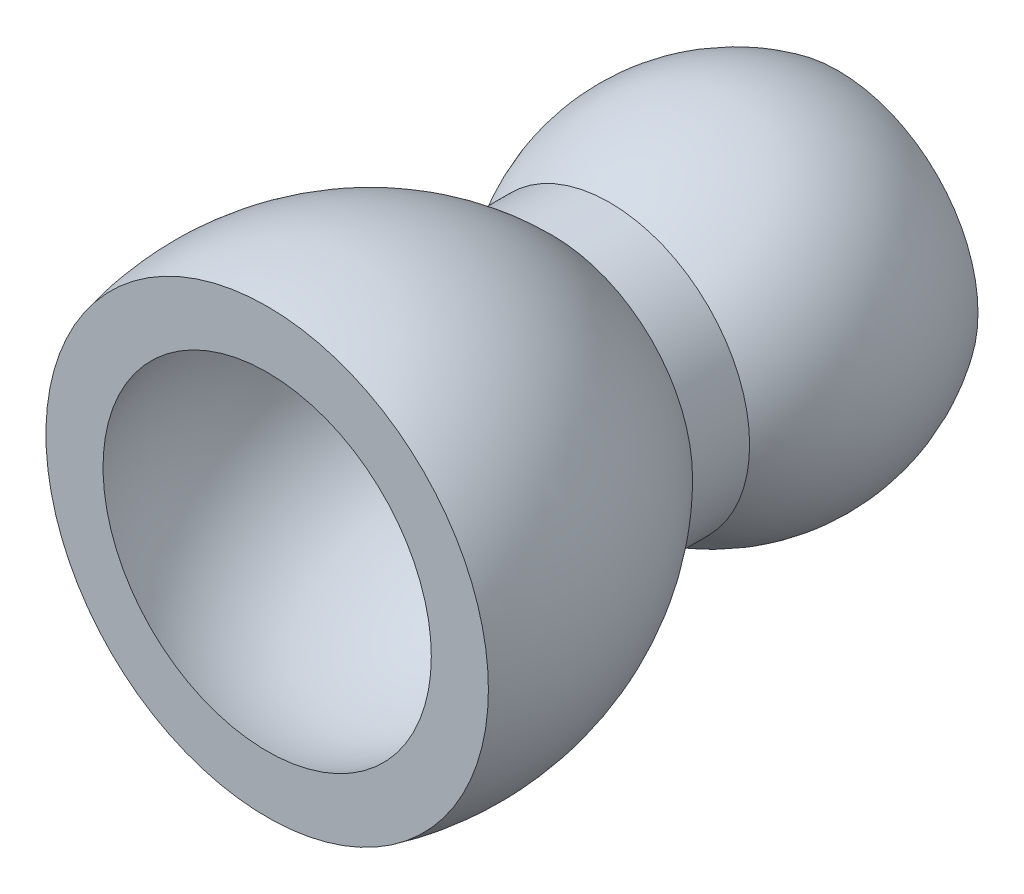
ISO-10303-21;
HEADER;
FILE_DESCRIPTION(('STEP AP214'),'2;1');
FILE_NAME('part.step','',(''),(''),'','','');
FILE_SCHEMA(('AUTOMOTIVE_DESIGN { 1 0 10303 214 1 1 1 1 }'));
ENDSEC;
DATA;
#1=APPLICATION_CONTEXT('core data for automotive mechanical design processes');
#2=APPLICATION_PROTOCOL_DEFINITION('international standard','automotive_design',2000,#1);
#3=PRODUCT_CONTEXT('',#1,'mechanical');
#4=PRODUCT('Part','Part','',(#3));
#5=PRODUCT_RELATED_PRODUCT_CATEGORY('part','',(#4));
#6=PRODUCT_DEFINITION_FORMATION('','',#4);
#7=PRODUCT_DEFINITION_CONTEXT('part definition',#1,'design');
#8=PRODUCT_DEFINITION('design','',#6,#7);
#9=PRODUCT_DEFINITION_SHAPE('','',#8);
#10=(LENGTH_UNIT() NAMED_UNIT(*) SI_UNIT(.MILLI.,.METRE.));
#11=(NAMED_UNIT(*) PLANE_ANGLE_UNIT() SI_UNIT($,.RADIAN.));
#12=(NAMED_UNIT(*) SI_UNIT($,.STERADIAN.) SOLID_ANGLE_UNIT());
#13=UNCERTAINTY_MEASURE_WITH_UNIT(LENGTH_MEASURE(1.E-05),#10,'distance_accuracy_value','');
#14=(GEOMETRIC_REPRESENTATION_CONTEXT(3) GLOBAL_UNCERTAINTY_ASSIGNED_CONTEXT((#13)) GLOBAL_UNIT_ASSIGNED_CONTEXT((#10,
#11,#12)) REPRESENTATION_CONTEXT('',''));
#15=CARTESIAN_POINT('',(0.,0.,0.));
#16=DIRECTION('',(0.,0.,1.));
#17=DIRECTION('',(1.,0.,0.));
#18=AXIS2_PLACEMENT_3D('',#15,#16,#17);
#19=CARTESIAN_POINT('',(0.,7.75,8.));
#20=DIRECTION('',(0.,0.,1.));
#21=DIRECTION('',(0.,-1.,0.));
#22=AXIS2_PLACEMENT_3D('',#19,#20,#21);
#23=PLANE('',#22);
#24=CARTESIAN_POINT('',(0.,0.,8.));
#25=DIRECTION('',(0.,0.,-1.));
#26=DIRECTION('',(1.,0.,0.));
#27=AXIS2_PLACEMENT_3D('',#24,#25,#26);
#28=CIRCLE('',#27,5.75);
#29=CARTESIAN_POINT('',(0.,5.75,8.));
#30=VERTEX_POINT('',#29);
#31=CARTESIAN_POINT('',(5.75,0.,8.));
#32=VERTEX_POINT('',#31);
#33=EDGE_CURVE('E29',#30,#32,#28,.T.);
#34=ORIENTED_EDGE('',*,*,#33,.T.);
#35=CARTESIAN_POINT('',(0.,0.,8.));
#36=DIRECTION('',(0.,0.,-1.));
#37=DIRECTION('',(1.,0.,0.));
#38=AXIS2_PLACEMENT_3D('',#35,#36,#37);
#39=CIRCLE('',#38,5.75);
#40=EDGE_CURVE('E11',#32,#30,#39,.T.);
#41=ORIENTED_EDGE('',*,*,#40,.T.);
#42=EDGE_LOOP('',(#34,#41));
#43=FACE_BOUND('',#42,.T.);
#44=CARTESIAN_POINT('',(0.,0.,8.));
#45=DIRECTION('',(0.,0.,-1.));
#46=DIRECTION('',(1.,0.,0.));
#47=AXIS2_PLACEMENT_3D('',#44,#45,#46);
#48=CIRCLE('',#47,7.75);
#49=CARTESIAN_POINT('',(0.,7.75,8.));
#50=VERTEX_POINT('',#49);
#51=CARTESIAN_POINT('',(7.75,0.,8.));
#52=VERTEX_POINT('',#51);
#53=EDGE_CURVE('E150',#50,#52,#48,.T.);
#54=ORIENTED_EDGE('',*,*,#53,.F.);
#55=CARTESIAN_POINT('',(0.,0.,8.));
#56=DIRECTION('',(0.,0.,-1.));
#57=DIRECTION('',(1.,0.,0.));
#58=AXIS2_PLACEMENT_3D('',#55,#56,#57);
#59=CIRCLE('',#58,7.75);
#60=EDGE_CURVE('E154',#52,#50,#59,.T.);
#61=ORIENTED_EDGE('',*,*,#60,.F.);
#62=EDGE_LOOP('',(#54,#61));
#63=FACE_BOUND('',#62,.T.);
#64=ADVANCED_FACE('F16',(#43,#63),#23,.T.);
#65=CARTESIAN_POINT('',(5.75,0.,8.));
#66=CARTESIAN_POINT('',(5.75,-5.75,7.99999999999999));
#67=CARTESIAN_POINT('',(0.,-5.75,8.));
#68=CARTESIAN_POINT('',(-5.75,-5.75,7.99999999999999));
#69=CARTESIAN_POINT('',(-5.75,0.,8.));
#70=CARTESIAN_POINT('',(-5.75,5.75,7.99999999999999));
#71=CARTESIAN_POINT('',(0.,5.75,8.));
#72=CARTESIAN_POINT('',(5.75,5.75,7.99999999999999));
#73=CARTESIAN_POINT('',(5.75,0.,8.));
#74=CARTESIAN_POINT('',(7.25472536348951,0.,3.43812600969305));
#75=CARTESIAN_POINT('',(7.2547253634895,-7.2547253634895,3.43812600969305));
#76=CARTESIAN_POINT('',(0.,-7.25472536348951,3.43812600969305));
#77=CARTESIAN_POINT('',(-7.2547253634895,-7.2547253634895,3.43812600969305));
#78=CARTESIAN_POINT('',(-7.25472536348951,0.,3.43812600969305));
#79=CARTESIAN_POINT('',(-7.2547253634895,7.2547253634895,3.43812600969305));
#80=CARTESIAN_POINT('',(0.,7.25472536348951,3.43812600969305));
#81=CARTESIAN_POINT('',(7.2547253634895,7.2547253634895,3.43812600969305));
#82=CARTESIAN_POINT('',(7.25472536348951,0.,3.43812600969305));
#83=CARTESIAN_POINT('',(3.9,0.,0.));
#84=CARTESIAN_POINT('',(3.9,-3.9,0.));
#85=CARTESIAN_POINT('',(0.,-3.9,0.));
#86=CARTESIAN_POINT('',(-3.9,-3.9,0.));
#87=CARTESIAN_POINT('',(-3.9,0.,0.));
#88=CARTESIAN_POINT('',(-3.9,3.9,0.));
#89=CARTESIAN_POINT('',(0.,3.9,0.));
#90=CARTESIAN_POINT('',(3.9,3.9,0.));
#91=CARTESIAN_POINT('',(3.9,0.,0.));
#92=(BOUNDED_SURFACE() B_SPLINE_SURFACE(2,2,((#65,#66,#67,#68,#69,#70,#71,#72,#73),(#74,#75,#76,
#77,#78,#79,#80,#81,#82),(#83,#84,#85,#86,#87,#88,#89,#90,#91)),.UNSPECIFIED.,.F.,.T.,
.F.) B_SPLINE_SURFACE_WITH_KNOTS((3,3),(3,2,2,2,3),(-0.318610550943975,0.773121072182338),
(-3.14159265358979,-1.5707963267949,0.,1.5707963267949,3.14159265358979),
.UNSPECIFIED.) GEOMETRIC_REPRESENTATION_ITEM() RATIONAL_B_SPLINE_SURFACE(((1.,0.707106781186548,
1.,0.707106781186548,1.,0.707106781186548,1.,0.707106781186548,1.),(0.85467811794493,
0.604348692930616,0.85467811794493,0.604348692930616,0.85467811794493,0.604348692930616,
0.85467811794493,0.604348692930616,0.85467811794493),(1.,0.707106781186548,1.,0.707106781186548,
1.,0.707106781186548,1.,0.707106781186548,1.))) REPRESENTATION_ITEM('') SURFACE());
#93=CARTESIAN_POINT('',(0.,0.,0.));
#94=DIRECTION('',(0.,0.,-1.));
#95=DIRECTION('',(1.,0.,0.));
#96=AXIS2_PLACEMENT_3D('',#93,#94,#95);
#97=CIRCLE('',#96,3.9);
#98=CARTESIAN_POINT('',(0.,3.9,0.));
#99=VERTEX_POINT('',#98);
#100=CARTESIAN_POINT('',(3.9,0.,0.));
#101=VERTEX_POINT('',#100);
#102=EDGE_CURVE('E141',#99,#101,#97,.T.);
#103=CARTESIAN_POINT('',(-1.76010638297872,0.,5.52280585106383));
#104=DIRECTION('',(0.,-1.,0.));
#105=DIRECTION('',(1.,0.,0.));
#106=AXIS2_PLACEMENT_3D('',#103,#104,#105);
#107=CIRCLE('',#106,7.90810904927223);
#108=EDGE_CURVE('E148',#101,#32,#107,.T.);
#109=CARTESIAN_POINT('',(0.,0.,0.));
#110=DIRECTION('',(0.,0.,-1.));
#111=DIRECTION('',(1.,0.,0.));
#112=AXIS2_PLACEMENT_3D('',#109,#110,#111);
#113=CIRCLE('',#112,3.9);
#114=CARTESIAN_POINT('',(0.,-3.9,0.));
#115=VERTEX_POINT('',#114);
#116=EDGE_CURVE('E146',#101,#115,#113,.T.);
#117=CARTESIAN_POINT('',(0.,0.,0.));
#118=DIRECTION('',(0.,0.,-1.));
#119=DIRECTION('',(1.,0.,0.));
#120=AXIS2_PLACEMENT_3D('',#117,#118,#119);
#121=CIRCLE('',#120,3.9);
#122=EDGE_CURVE('E145',#115,#99,#121,.T.);
#123=ORIENTED_EDGE('',*,*,#102,.T.);
#124=ORIENTED_EDGE('',*,*,#108,.T.);
#125=ORIENTED_EDGE('',*,*,#33,.F.);
#126=ORIENTED_EDGE('',*,*,#40,.F.);
#127=ORIENTED_EDGE('',*,*,#108,.F.);
#128=ORIENTED_EDGE('',*,*,#116,.T.);
#129=ORIENTED_EDGE('',*,*,#122,.T.);
#130=EDGE_LOOP('',(#123,#124,#125,#126,#127,#128,#129));
#131=FACE_BOUND('',#130,.T.);
#132=ADVANCED_FACE('F18',(#131),#92,.T.);
#133=CARTESIAN_POINT('',(0.,0.,-6.));
#134=DIRECTION('',(0.,0.,-1.));
#135=DIRECTION('',(0.,1.,0.));
#136=AXIS2_PLACEMENT_3D('',#133,#134,#135);
#137=CYLINDRICAL_SURFACE('',#136,3.9);
#138=CARTESIAN_POINT('',(0.,0.,-12.));
#139=DIRECTION('',(0.,0.,-1.));
#140=DIRECTION('',(1.,0.,0.));
#141=AXIS2_PLACEMENT_3D('',#138,#139,#140);
#142=CIRCLE('',#141,3.9);
#143=CARTESIAN_POINT('',(0.,3.9,-12.));
#144=VERTEX_POINT('',#143);
#145=CARTESIAN_POINT('',(0.,-3.9,-12.));
#146=VERTEX_POINT('',#145);
#147=EDGE_CURVE('E139',#144,#146,#142,.T.);
#148=ORIENTED_EDGE('',*,*,#147,.T.);
#149=DIRECTION('',(0.,0.,1.));
#150=VECTOR('',#149,1.);
#151=CARTESIAN_POINT('',(0.,-3.9,-6.));
#152=LINE('',#151,#150);
#153=EDGE_CURVE('E163',#146,#115,#152,.T.);
#154=ORIENTED_EDGE('',*,*,#153,.T.);
#155=ORIENTED_EDGE('',*,*,#116,.F.);
#156=ORIENTED_EDGE('',*,*,#102,.F.);
#157=ORIENTED_EDGE('',*,*,#122,.F.);
#158=ORIENTED_EDGE('',*,*,#153,.F.);
#159=CARTESIAN_POINT('',(0.,0.,-12.));
#160=DIRECTION('',(0.,0.,-1.));
#161=DIRECTION('',(1.,0.,0.));
#162=AXIS2_PLACEMENT_3D('',#159,#160,#161);
#163=CIRCLE('',#162,3.9);
#164=EDGE_CURVE('E97',#146,#144,#163,.T.);
#165=ORIENTED_EDGE('',*,*,#164,.T.);
#166=EDGE_LOOP('',(#148,#154,#155,#156,#157,#158,#165));
#167=FACE_BOUND('',#166,.T.);
#168=ADVANCED_FACE('F200',(#167),#137,.F.);
#169=CARTESIAN_POINT('',(0.,3.9,-12.));
#170=DIRECTION('',(0.,0.,-1.));
#171=DIRECTION('',(-1.,0.,0.));
#172=AXIS2_PLACEMENT_3D('',#169,#170,#171);
#173=PLANE('',#172);
#174=ORIENTED_EDGE('',*,*,#147,.F.);
#175=ORIENTED_EDGE('',*,*,#164,.F.);
#176=EDGE_LOOP('',(#174,#175));
#177=FACE_BOUND('',#176,.T.);
#178=CARTESIAN_POINT('',(0.,0.,-12.));
#179=DIRECTION('',(0.,0.,-1.));
#180=DIRECTION('',(1.,0.,0.));
#181=AXIS2_PLACEMENT_3D('',#178,#179,#180);
#182=CIRCLE('',#181,4.9);
#183=CARTESIAN_POINT('',(0.,4.9,-12.));
#184=VERTEX_POINT('',#183);
#185=CARTESIAN_POINT('',(4.9,0.,-12.));
#186=VERTEX_POINT('',#185);
#187=EDGE_CURVE('E155',#184,#186,#182,.T.);
#188=ORIENTED_EDGE('',*,*,#187,.T.);
#189=CARTESIAN_POINT('',(0.,0.,-12.));
#190=DIRECTION('',(0.,0.,-1.));
#191=DIRECTION('',(1.,0.,0.));
#192=AXIS2_PLACEMENT_3D('',#189,#190,#191);
#193=CIRCLE('',#192,4.9);
#194=EDGE_CURVE('E140',#186,#184,#193,.T.);
#195=ORIENTED_EDGE('',*,*,#194,.T.);
#196=EDGE_LOOP('',(#188,#195));
#197=FACE_BOUND('',#196,.T.);
#198=ADVANCED_FACE('F206',(#177,#197),#173,.T.);
#199=CARTESIAN_POINT('',(4.9,0.,-4.));
#200=CARTESIAN_POINT('',(4.9,-4.9,-4.));
#201=CARTESIAN_POINT('',(0.,-4.9,-4.));
#202=CARTESIAN_POINT('',(-4.9,-4.9,-4.));
#203=CARTESIAN_POINT('',(-4.9,0.,-4.));
#204=CARTESIAN_POINT('',(-4.9,4.9,-4.));
#205=CARTESIAN_POINT('',(0.,4.9,-4.));
#206=CARTESIAN_POINT('',(4.9,4.9,-4.));
#207=CARTESIAN_POINT('',(4.9,0.,-4.));
#208=CARTESIAN_POINT('',(7.67056277056278,0.,-8.));
#209=CARTESIAN_POINT('',(7.67056277056277,-7.67056277056277,-8.));
#210=CARTESIAN_POINT('',(0.,-7.67056277056278,-8.));
#211=CARTESIAN_POINT('',(-7.67056277056277,-7.67056277056277,-8.));
#212=CARTESIAN_POINT('',(-7.67056277056278,0.,-8.));
#213=CARTESIAN_POINT('',(-7.67056277056277,7.67056277056277,-8.));
#214=CARTESIAN_POINT('',(0.,7.67056277056278,-8.));
#215=CARTESIAN_POINT('',(7.67056277056277,7.67056277056277,-8.));
#216=CARTESIAN_POINT('',(7.67056277056278,0.,-8.));
#217=CARTESIAN_POINT('',(4.9,0.,-12.));
#218=CARTESIAN_POINT('',(4.9,-4.9,-12.));
#219=CARTESIAN_POINT('',(0.,-4.9,-12.));
#220=CARTESIAN_POINT('',(-4.9,-4.9,-12.));
#221=CARTESIAN_POINT('',(-4.9,0.,-12.));
#222=CARTESIAN_POINT('',(-4.9,4.9,-12.));
#223=CARTESIAN_POINT('',(0.,4.9,-12.));
#224=CARTESIAN_POINT('',(4.9,4.9,-12.));
#225=CARTESIAN_POINT('',(4.9,0.,-12.));
#226=(BOUNDED_SURFACE() B_SPLINE_SURFACE(2,2,((#199,#200,#201,#202,#203,#204,#205,#206,#207),
(#208,#209,#210,#211,#212,#213,#214,#215,#216),(#217,#218,#219,#220,#221,#222,#223,#224,#225)),
.UNSPECIFIED.,.F.,.T.,.F.) B_SPLINE_SURFACE_WITH_KNOTS((3,3),(3,2,2,2,3),(-0.605769736749944,
0.605769736749943),(-3.14159265358979,-1.5707963267949,0.,1.5707963267949,3.14159265358979),
.UNSPECIFIED.) GEOMETRIC_REPRESENTATION_ITEM() RATIONAL_B_SPLINE_SURFACE(((1.,0.707106781186548,
1.,0.707106781186548,1.,0.707106781186548,1.,0.707106781186548,1.),(0.822064056939501,
0.581287069231645,0.822064056939501,0.581287069231645,0.822064056939501,0.581287069231645,
0.822064056939501,0.581287069231645,0.822064056939501),(1.,0.707106781186548,1.,
0.707106781186548,1.,0.707106781186548,1.,0.707106781186548,1.))) REPRESENTATION_ITEM('') SURFACE());
#227=CARTESIAN_POINT('',(-0.87499999999999,0.,-8.));
#228=DIRECTION('',(0.,-1.,0.));
#229=DIRECTION('',(1.,0.,0.));
#230=AXIS2_PLACEMENT_3D('',#227,#228,#229);
#231=CIRCLE('',#230,7.025);
#232=CARTESIAN_POINT('',(4.9,0.,-4.));
#233=VERTEX_POINT('',#232);
#234=EDGE_CURVE('E75',#186,#233,#231,.T.);
#235=CARTESIAN_POINT('',(0.,0.,-4.));
#236=DIRECTION('',(0.,0.,-1.));
#237=DIRECTION('',(1.,0.,0.));
#238=AXIS2_PLACEMENT_3D('',#235,#236,#237);
#239=CIRCLE('',#238,4.9);
#240=CARTESIAN_POINT('',(0.,-4.9,-4.));
#241=VERTEX_POINT('',#240);
#242=EDGE_CURVE('E159',#233,#241,#239,.T.);
#243=CARTESIAN_POINT('',(0.,0.,-4.));
#244=DIRECTION('',(0.,0.,-1.));
#245=DIRECTION('',(1.,0.,0.));
#246=AXIS2_PLACEMENT_3D('',#243,#244,#245);
#247=CIRCLE('',#246,4.9);
#248=CARTESIAN_POINT('',(0.,4.9,-4.));
#249=VERTEX_POINT('',#248);
#250=EDGE_CURVE('E22',#241,#249,#247,.T.);
#251=CARTESIAN_POINT('',(0.,0.,-4.));
#252=DIRECTION('',(0.,0.,-1.));
#253=DIRECTION('',(1.,0.,0.));
#254=AXIS2_PLACEMENT_3D('',#251,#252,#253);
#255=CIRCLE('',#254,4.9);
#256=EDGE_CURVE('E153',#249,#233,#255,.T.);
#257=ORIENTED_EDGE('',*,*,#187,.F.);
#258=ORIENTED_EDGE('',*,*,#194,.F.);
#259=ORIENTED_EDGE('',*,*,#234,.T.);
#260=ORIENTED_EDGE('',*,*,#242,.T.);
#261=ORIENTED_EDGE('',*,*,#250,.T.);
#262=ORIENTED_EDGE('',*,*,#256,.T.);
#263=ORIENTED_EDGE('',*,*,#234,.F.);
#264=EDGE_LOOP('',(#257,#258,#259,#260,#261,#262,#263));
#265=FACE_BOUND('',#264,.T.);
#266=ADVANCED_FACE('F208',(#265),#226,.F.);
#267=CARTESIAN_POINT('',(0.,0.,-3.));
#268=DIRECTION('',(0.,0.,-1.));
#269=DIRECTION('',(0.,1.,0.));
#270=AXIS2_PLACEMENT_3D('',#267,#268,#269);
#271=CYLINDRICAL_SURFACE('',#270,4.9);
#272=ORIENTED_EDGE('',*,*,#256,.F.);
#273=ORIENTED_EDGE('',*,*,#250,.F.);
#274=DIRECTION('',(0.,0.,1.));
#275=VECTOR('',#274,1.);
#276=CARTESIAN_POINT('',(0.,-4.9,-3.));
#277=LINE('',#276,#275);
#278=CARTESIAN_POINT('',(0.,-4.9,-2.));
#279=VERTEX_POINT('',#278);
#280=EDGE_CURVE('E121',#241,#279,#277,.T.);
#281=ORIENTED_EDGE('',*,*,#280,.T.);
#282=CARTESIAN_POINT('',(0.,0.,-2.));
#283=DIRECTION('',(0.,0.,-1.));
#284=DIRECTION('',(1.,0.,0.));
#285=AXIS2_PLACEMENT_3D('',#282,#283,#284);
#286=CIRCLE('',#285,4.9);
#287=CARTESIAN_POINT('',(0.,4.9,-2.));
#288=VERTEX_POINT('',#287);
#289=EDGE_CURVE('E115',#279,#288,#286,.T.);
#290=ORIENTED_EDGE('',*,*,#289,.T.);
#291=CARTESIAN_POINT('',(0.,0.,-2.));
#292=DIRECTION('',(0.,0.,-1.));
#293=DIRECTION('',(1.,0.,0.));
#294=AXIS2_PLACEMENT_3D('',#291,#292,#293);
#295=CIRCLE('',#294,4.9);
#296=CARTESIAN_POINT('',(4.9,0.,-2.));
#297=VERTEX_POINT('',#296);
#298=EDGE_CURVE('E119',#288,#297,#295,.T.);
#299=ORIENTED_EDGE('',*,*,#298,.T.);
#300=CARTESIAN_POINT('',(0.,0.,-2.));
#301=DIRECTION('',(0.,0.,-1.));
#302=DIRECTION('',(1.,0.,0.));
#303=AXIS2_PLACEMENT_3D('',#300,#301,#302);
#304=CIRCLE('',#303,4.9);
#305=EDGE_CURVE('E125',#297,#279,#304,.T.);
#306=ORIENTED_EDGE('',*,*,#305,.T.);
#307=ORIENTED_EDGE('',*,*,#280,.F.);
#308=ORIENTED_EDGE('',*,*,#242,.F.);
#309=EDGE_LOOP('',(#272,#273,#281,#290,#299,#306,#307,#308));
#310=FACE_BOUND('',#309,.T.);
#311=ADVANCED_FACE('F117',(#310),#271,.T.);
#312=CARTESIAN_POINT('',(7.75,0.,8.));
#313=CARTESIAN_POINT('',(7.75,-7.75,7.99999999999999));
#314=CARTESIAN_POINT('',(0.,-7.75,8.));
#315=CARTESIAN_POINT('',(-7.75,-7.75,7.99999999999999));
#316=CARTESIAN_POINT('',(-7.75,0.,8.));
#317=CARTESIAN_POINT('',(-7.75,7.75,7.99999999999999));
#318=CARTESIAN_POINT('',(0.,7.75,8.));
#319=CARTESIAN_POINT('',(7.75,7.75,7.99999999999999));
#320=CARTESIAN_POINT('',(7.75,0.,8.));
#321=CARTESIAN_POINT('',(9.1492363545318,0.,2.19509263895843));
#322=CARTESIAN_POINT('',(9.1492363545318,-9.1492363545318,2.19509263895843));
#323=CARTESIAN_POINT('',(0.,-9.1492363545318,2.19509263895843));
#324=CARTESIAN_POINT('',(-9.1492363545318,-9.1492363545318,2.19509263895843));
#325=CARTESIAN_POINT('',(-9.1492363545318,0.,2.19509263895843));
#326=CARTESIAN_POINT('',(-9.1492363545318,9.1492363545318,2.19509263895843));
#327=CARTESIAN_POINT('',(0.,9.1492363545318,2.19509263895843));
#328=CARTESIAN_POINT('',(9.1492363545318,9.1492363545318,2.19509263895843));
#329=CARTESIAN_POINT('',(9.1492363545318,0.,2.19509263895843));
#330=CARTESIAN_POINT('',(4.9,0.,-2.));
#331=CARTESIAN_POINT('',(4.9,-4.9,-2.));
#332=CARTESIAN_POINT('',(0.,-4.9,-2.));
#333=CARTESIAN_POINT('',(-4.9,-4.9,-2.));
#334=CARTESIAN_POINT('',(-4.9,0.,-2.));
#335=CARTESIAN_POINT('',(-4.9,4.9,-2.));
#336=CARTESIAN_POINT('',(0.,4.9,-2.));
#337=CARTESIAN_POINT('',(4.9,4.9,-2.));
#338=CARTESIAN_POINT('',(4.9,0.,-2.));
#339=(BOUNDED_SURFACE() B_SPLINE_SURFACE(2,2,((#312,#313,#314,#315,#316,#317,#318,#319,#320),
(#321,#322,#323,#324,#325,#326,#327,#328,#329),(#330,#331,#332,#333,#334,#335,#336,#337,#338)),
.UNSPECIFIED.,.F.,.T.,.F.) B_SPLINE_SURFACE_WITH_KNOTS((3,3),(3,2,2,2,3),(-0.236531604746139,
0.791809918985451),(-3.14159265358979,-1.5707963267949,0.,1.5707963267949,3.14159265358979),
.UNSPECIFIED.) GEOMETRIC_REPRESENTATION_ITEM() RATIONAL_B_SPLINE_SURFACE(((1.,0.707106781186548,
1.,0.707106781186548,1.,0.707106781186548,1.,0.707106781186548,1.),(0.870700851708266,
0.615678476627817,0.870700851708266,0.615678476627817,0.870700851708266,0.615678476627817,
0.870700851708266,0.615678476627817,0.870700851708266),(1.,0.707106781186548,1.,
0.707106781186548,1.,0.707106781186548,1.,0.707106781186548,1.))) REPRESENTATION_ITEM('') SURFACE());
#340=CARTESIAN_POINT('',(-2.52695035460992,0.,5.52280585106383));
#341=DIRECTION('',(0.,-1.,0.));
#342=DIRECTION('',(1.,0.,0.));
#343=AXIS2_PLACEMENT_3D('',#340,#341,#342);
#344=CIRCLE('',#343,10.5712912854883);
#345=EDGE_CURVE('E130',#297,#52,#344,.T.);
#346=ORIENTED_EDGE('',*,*,#298,.F.);
#347=ORIENTED_EDGE('',*,*,#289,.F.);
#348=ORIENTED_EDGE('',*,*,#305,.F.);
#349=ORIENTED_EDGE('',*,*,#345,.T.);
#350=ORIENTED_EDGE('',*,*,#60,.T.);
#351=ORIENTED_EDGE('',*,*,#53,.T.);
#352=ORIENTED_EDGE('',*,*,#345,.F.);
#353=EDGE_LOOP('',(#346,#347,#348,#349,#350,#351,#352));
#354=FACE_BOUND('',#353,.T.);
#355=ADVANCED_FACE('F127',(#354),#339,.F.);
#356=CLOSED_SHELL('',(#64,#132,#168,#198,#266,#311,#355));
#357=MANIFOLD_SOLID_BREP('B1',#356);
#358=ADVANCED_BREP_SHAPE_REPRESENTATION('',(#18,#357),#14);
#359=SHAPE_DEFINITION_REPRESENTATION(#9,#358);
ENDSEC;
END-ISO-10303-21;
